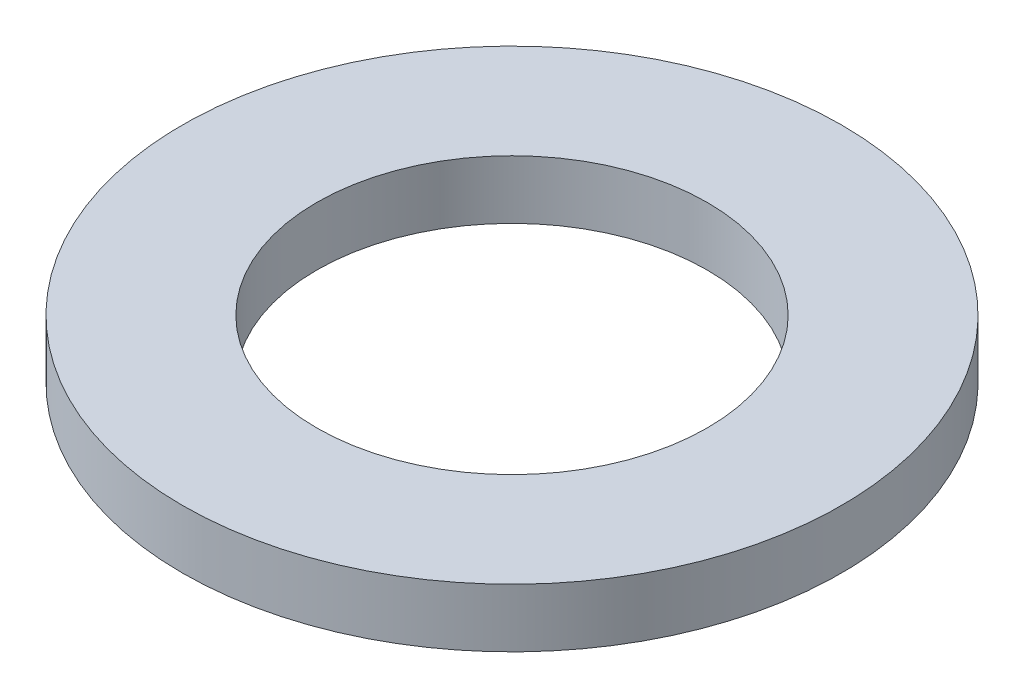
ISO-10303-21;
HEADER;
FILE_DESCRIPTION(('STEP AP214'),'2;1');
FILE_NAME('part.step','',(''),(''),'','','');
FILE_SCHEMA(('AUTOMOTIVE_DESIGN { 1 0 10303 214 1 1 1 1 }'));
ENDSEC;
DATA;
#1=APPLICATION_CONTEXT('core data for automotive mechanical design processes');
#2=APPLICATION_PROTOCOL_DEFINITION('international standard','automotive_design',2000,#1);
#3=PRODUCT_CONTEXT('',#1,'mechanical');
#4=PRODUCT('Part','Part','',(#3));
#5=PRODUCT_RELATED_PRODUCT_CATEGORY('part','',(#4));
#6=PRODUCT_DEFINITION_FORMATION('','',#4);
#7=PRODUCT_DEFINITION_CONTEXT('part definition',#1,'design');
#8=PRODUCT_DEFINITION('design','',#6,#7);
#9=PRODUCT_DEFINITION_SHAPE('','',#8);
#10=(LENGTH_UNIT() NAMED_UNIT(*) SI_UNIT(.MILLI.,.METRE.));
#11=(NAMED_UNIT(*) PLANE_ANGLE_UNIT() SI_UNIT($,.RADIAN.));
#12=(NAMED_UNIT(*) SI_UNIT($,.STERADIAN.) SOLID_ANGLE_UNIT());
#13=UNCERTAINTY_MEASURE_WITH_UNIT(LENGTH_MEASURE(1.E-05),#10,'distance_accuracy_value','');
#14=(GEOMETRIC_REPRESENTATION_CONTEXT(3) GLOBAL_UNCERTAINTY_ASSIGNED_CONTEXT((#13)) GLOBAL_UNIT_ASSIGNED_CONTEXT((#10,
#11,#12)) REPRESENTATION_CONTEXT('',''));
#15=CARTESIAN_POINT('',(0.,0.,0.));
#16=DIRECTION('',(0.,0.,1.));
#17=DIRECTION('',(1.,0.,0.));
#18=AXIS2_PLACEMENT_3D('',#15,#16,#17);
#19=CARTESIAN_POINT('',(0.,12.,0.));
#20=DIRECTION('',(0.,-1.,0.));
#21=DIRECTION('',(0.,0.,-1.));
#22=AXIS2_PLACEMENT_3D('',#19,#20,#21);
#23=CYLINDRICAL_SURFACE('',#22,67.5);
#24=CARTESIAN_POINT('',(0.,12.,0.));
#25=DIRECTION('',(0.,1.,0.));
#26=DIRECTION('',(0.,0.,1.));
#27=AXIS2_PLACEMENT_3D('',#24,#25,#26);
#28=CIRCLE('',#27,67.5);
#29=CARTESIAN_POINT('',(0.,12.,67.5));
#30=VERTEX_POINT('',#29);
#31=EDGE_CURVE('E10',#30,#30,#28,.T.);
#32=ORIENTED_EDGE('',*,*,#31,.F.);
#33=EDGE_LOOP('',(#32));
#34=FACE_BOUND('',#33,.T.);
#35=CARTESIAN_POINT('',(0.,0.,0.));
#36=DIRECTION('',(0.,1.,0.));
#37=DIRECTION('',(0.,0.,1.));
#38=AXIS2_PLACEMENT_3D('',#35,#36,#37);
#39=CIRCLE('',#38,67.5);
#40=CARTESIAN_POINT('',(0.,0.,67.5));
#41=VERTEX_POINT('',#40);
#42=EDGE_CURVE('E37',#41,#41,#39,.T.);
#43=ORIENTED_EDGE('',*,*,#42,.T.);
#44=EDGE_LOOP('',(#43));
#45=FACE_BOUND('',#44,.T.);
#46=ADVANCED_FACE('F40',(#34,#45),#23,.T.);
#47=CARTESIAN_POINT('',(0.,12.,0.));
#48=DIRECTION('',(0.,1.,0.));
#49=DIRECTION('',(0.,0.,1.));
#50=AXIS2_PLACEMENT_3D('',#47,#48,#49);
#51=PLANE('',#50);
#52=CARTESIAN_POINT('',(0.,12.,0.));
#53=DIRECTION('',(0.,1.,0.));
#54=DIRECTION('',(0.,0.,1.));
#55=AXIS2_PLACEMENT_3D('',#52,#53,#54);
#56=CIRCLE('',#55,40.);
#57=CARTESIAN_POINT('',(0.,12.,40.));
#58=VERTEX_POINT('',#57);
#59=EDGE_CURVE('E50',#58,#58,#56,.T.);
#60=ORIENTED_EDGE('',*,*,#59,.F.);
#61=EDGE_LOOP('',(#60));
#62=FACE_BOUND('',#61,.T.);
#63=ORIENTED_EDGE('',*,*,#31,.T.);
#64=EDGE_LOOP('',(#63));
#65=FACE_BOUND('',#64,.T.);
#66=ADVANCED_FACE('F59',(#62,#65),#51,.T.);
#67=CARTESIAN_POINT('',(0.,0.,0.));
#68=DIRECTION('',(0.,1.,0.));
#69=DIRECTION('',(0.,0.,1.));
#70=AXIS2_PLACEMENT_3D('',#67,#68,#69);
#71=PLANE('',#70);
#72=CARTESIAN_POINT('',(0.,0.,0.));
#73=DIRECTION('',(0.,1.,0.));
#74=DIRECTION('',(0.,0.,1.));
#75=AXIS2_PLACEMENT_3D('',#72,#73,#74);
#76=CIRCLE('',#75,40.);
#77=CARTESIAN_POINT('',(0.,0.,40.));
#78=VERTEX_POINT('',#77);
#79=EDGE_CURVE('E47',#78,#78,#76,.T.);
#80=ORIENTED_EDGE('',*,*,#79,.T.);
#81=EDGE_LOOP('',(#80));
#82=FACE_BOUND('',#81,.T.);
#83=ORIENTED_EDGE('',*,*,#42,.F.);
#84=EDGE_LOOP('',(#83));
#85=FACE_BOUND('',#84,.T.);
#86=ADVANCED_FACE('F58',(#82,#85),#71,.F.);
#87=CARTESIAN_POINT('',(0.,12.,0.));
#88=DIRECTION('',(0.,-1.,0.));
#89=DIRECTION('',(0.,0.,-1.));
#90=AXIS2_PLACEMENT_3D('',#87,#88,#89);
#91=CYLINDRICAL_SURFACE('',#90,40.);
#92=ORIENTED_EDGE('',*,*,#59,.T.);
#93=EDGE_LOOP('',(#92));
#94=FACE_BOUND('',#93,.T.);
#95=ORIENTED_EDGE('',*,*,#79,.F.);
#96=EDGE_LOOP('',(#95));
#97=FACE_BOUND('',#96,.T.);
#98=ADVANCED_FACE('F54',(#94,#97),#91,.F.);
#99=CLOSED_SHELL('',(#46,#66,#86,#98));
#100=MANIFOLD_SOLID_BREP('B2',#99);
#101=ADVANCED_BREP_SHAPE_REPRESENTATION('',(#18,#100),#14);
#102=SHAPE_DEFINITION_REPRESENTATION(#9,#101);
ENDSEC;
END-ISO-10303-21;
